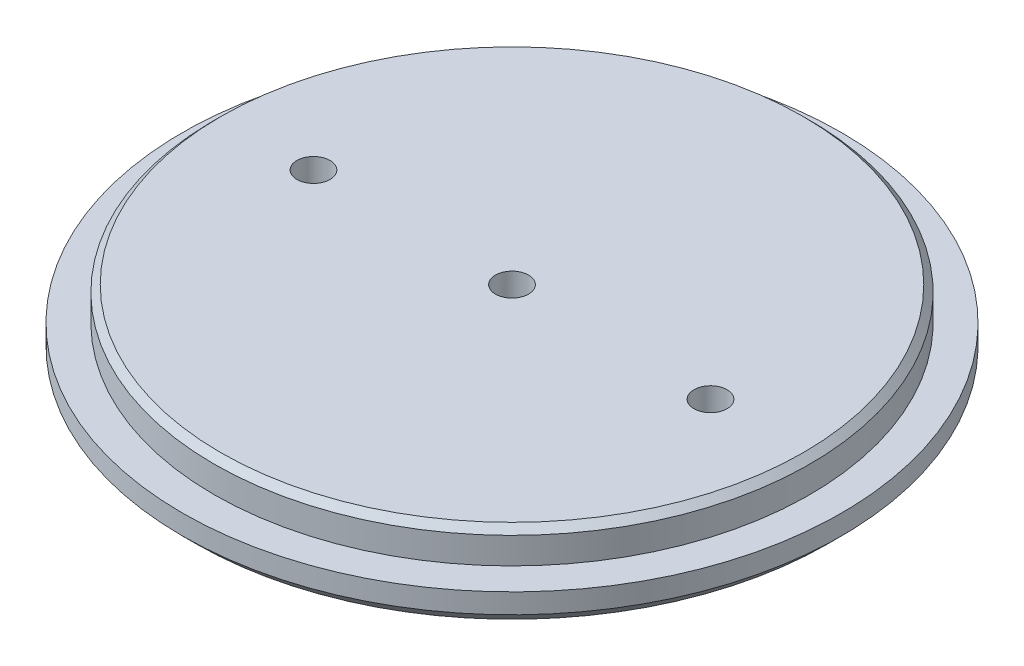
ISO-10303-21;
HEADER;
FILE_DESCRIPTION(('STEP AP214'),'2;1');
FILE_NAME('part.step','',(''),(''),'','','');
FILE_SCHEMA(('AUTOMOTIVE_DESIGN { 1 0 10303 214 1 1 1 1 }'));
ENDSEC;
DATA;
#1=APPLICATION_CONTEXT('core data for automotive mechanical design processes');
#2=APPLICATION_PROTOCOL_DEFINITION('international standard','automotive_design',2000,#1);
#3=PRODUCT_CONTEXT('',#1,'mechanical');
#4=PRODUCT('Part','Part','',(#3));
#5=PRODUCT_RELATED_PRODUCT_CATEGORY('part','',(#4));
#6=PRODUCT_DEFINITION_FORMATION('','',#4);
#7=PRODUCT_DEFINITION_CONTEXT('part definition',#1,'design');
#8=PRODUCT_DEFINITION('design','',#6,#7);
#9=PRODUCT_DEFINITION_SHAPE('','',#8);
#10=(LENGTH_UNIT() NAMED_UNIT(*) SI_UNIT(.MILLI.,.METRE.));
#11=(NAMED_UNIT(*) PLANE_ANGLE_UNIT() SI_UNIT($,.RADIAN.));
#12=(NAMED_UNIT(*) SI_UNIT($,.STERADIAN.) SOLID_ANGLE_UNIT());
#13=UNCERTAINTY_MEASURE_WITH_UNIT(LENGTH_MEASURE(1.E-05),#10,'distance_accuracy_value','');
#14=(GEOMETRIC_REPRESENTATION_CONTEXT(3) GLOBAL_UNCERTAINTY_ASSIGNED_CONTEXT((#13)) GLOBAL_UNIT_ASSIGNED_CONTEXT((#10,
#11,#12)) REPRESENTATION_CONTEXT('',''));
#15=CARTESIAN_POINT('',(0.,0.,0.));
#16=DIRECTION('',(0.,0.,1.));
#17=DIRECTION('',(1.,0.,0.));
#18=AXIS2_PLACEMENT_3D('',#15,#16,#17);
#19=CARTESIAN_POINT('',(0.,6.35,0.));
#20=DIRECTION('',(0.,-1.,0.));
#21=DIRECTION('',(0.,0.,-1.));
#22=AXIS2_PLACEMENT_3D('',#19,#20,#21);
#23=CYLINDRICAL_SURFACE('',#22,63.2460000000001);
#24=CARTESIAN_POINT('',(0.,2.54,0.));
#25=DIRECTION('',(0.,1.,0.));
#26=DIRECTION('',(0.,0.,1.));
#27=AXIS2_PLACEMENT_3D('',#24,#25,#26);
#28=CIRCLE('',#27,63.2460000000001);
#29=CARTESIAN_POINT('',(0.,2.54,63.2460000000001));
#30=VERTEX_POINT('',#29);
#31=EDGE_CURVE('E51',#30,#30,#28,.T.);
#32=ORIENTED_EDGE('',*,*,#31,.T.);
#33=EDGE_LOOP('',(#32));
#34=FACE_BOUND('',#33,.T.);
#35=CARTESIAN_POINT('',(0.,6.35,0.));
#36=DIRECTION('',(0.,1.,0.));
#37=DIRECTION('',(0.,0.,1.));
#38=AXIS2_PLACEMENT_3D('',#35,#36,#37);
#39=CIRCLE('',#38,63.2460000000001);
#40=CARTESIAN_POINT('',(0.,6.35,63.2460000000001));
#41=VERTEX_POINT('',#40);
#42=EDGE_CURVE('E68',#41,#41,#39,.T.);
#43=ORIENTED_EDGE('',*,*,#42,.F.);
#44=EDGE_LOOP('',(#43));
#45=FACE_BOUND('',#44,.T.);
#46=ADVANCED_FACE('F42',(#34,#45),#23,.T.);
#47=CARTESIAN_POINT('',(0.,6.35,0.));
#48=DIRECTION('',(0.,1.,0.));
#49=DIRECTION('',(0.,0.,1.));
#50=AXIS2_PLACEMENT_3D('',#47,#48,#49);
#51=PLANE('',#50);
#52=CARTESIAN_POINT('',(0.,6.35,0.));
#53=DIRECTION('',(0.,1.,0.));
#54=DIRECTION('',(0.,0.,1.));
#55=AXIS2_PLACEMENT_3D('',#52,#53,#54);
#56=CIRCLE('',#55,57.1500000000001);
#57=CARTESIAN_POINT('',(0.,6.35,57.1500000000001));
#58=VERTEX_POINT('',#57);
#59=EDGE_CURVE('E67',#58,#58,#56,.T.);
#60=ORIENTED_EDGE('',*,*,#59,.F.);
#61=EDGE_LOOP('',(#60));
#62=FACE_BOUND('',#61,.T.);
#63=ORIENTED_EDGE('',*,*,#42,.T.);
#64=EDGE_LOOP('',(#63));
#65=FACE_BOUND('',#64,.T.);
#66=ADVANCED_FACE('F114',(#62,#65),#51,.T.);
#67=CARTESIAN_POINT('',(0.,0.,0.));
#68=DIRECTION('',(0.,1.,0.));
#69=DIRECTION('',(0.,0.,1.));
#70=AXIS2_PLACEMENT_3D('',#67,#68,#69);
#71=PLANE('',#70);
#72=CARTESIAN_POINT('',(0.,0.,0.));
#73=DIRECTION('',(0.,1.,0.));
#74=DIRECTION('',(0.,0.,1.));
#75=AXIS2_PLACEMENT_3D('',#72,#73,#74);
#76=CIRCLE('',#75,60.7060000000001);
#77=CARTESIAN_POINT('',(0.,0.,60.7060000000001));
#78=VERTEX_POINT('',#77);
#79=EDGE_CURVE('E10',#78,#78,#76,.F.);
#80=ORIENTED_EDGE('',*,*,#79,.T.);
#81=EDGE_LOOP('',(#80));
#82=FACE_BOUND('',#81,.T.);
#83=CARTESIAN_POINT('',(-38.1,0.,0.));
#84=DIRECTION('',(0.,-1.,0.));
#85=DIRECTION('',(0.,0.,-1.));
#86=AXIS2_PLACEMENT_3D('',#83,#84,#85);
#87=CIRCLE('',#86,3.175);
#88=CARTESIAN_POINT('',(-38.1,0.,-3.175));
#89=VERTEX_POINT('',#88);
#90=EDGE_CURVE('E92',#89,#89,#87,.T.);
#91=ORIENTED_EDGE('',*,*,#90,.F.);
#92=EDGE_LOOP('',(#91));
#93=FACE_BOUND('',#92,.T.);
#94=CARTESIAN_POINT('',(0.,0.,0.));
#95=DIRECTION('',(0.,-1.,0.));
#96=DIRECTION('',(0.,0.,-1.));
#97=AXIS2_PLACEMENT_3D('',#94,#95,#96);
#98=CIRCLE('',#97,3.175);
#99=CARTESIAN_POINT('',(0.,0.,-3.175));
#100=VERTEX_POINT('',#99);
#101=EDGE_CURVE('E88',#100,#100,#98,.T.);
#102=ORIENTED_EDGE('',*,*,#101,.F.);
#103=EDGE_LOOP('',(#102));
#104=FACE_BOUND('',#103,.T.);
#105=CARTESIAN_POINT('',(38.1,0.,0.));
#106=DIRECTION('',(0.,-1.,0.));
#107=DIRECTION('',(0.,0.,-1.));
#108=AXIS2_PLACEMENT_3D('',#105,#106,#107);
#109=CIRCLE('',#108,3.175);
#110=CARTESIAN_POINT('',(38.1,0.,-3.17499999999998));
#111=VERTEX_POINT('',#110);
#112=EDGE_CURVE('E80',#111,#111,#109,.T.);
#113=ORIENTED_EDGE('',*,*,#112,.F.);
#114=EDGE_LOOP('',(#113));
#115=FACE_BOUND('',#114,.T.);
#116=ADVANCED_FACE('F110',(#82,#93,#104,#115),#71,.F.);
#117=CARTESIAN_POINT('',(0.,12.7,0.));
#118=DIRECTION('',(0.,-1.,0.));
#119=DIRECTION('',(0.,0.,-1.));
#120=AXIS2_PLACEMENT_3D('',#117,#118,#119);
#121=CYLINDRICAL_SURFACE('',#120,57.1500000000001);
#122=CARTESIAN_POINT('',(0.,11.43,0.));
#123=DIRECTION('',(0.,1.,0.));
#124=DIRECTION('',(0.,0.,1.));
#125=AXIS2_PLACEMENT_3D('',#122,#123,#124);
#126=CIRCLE('',#125,57.1500000000001);
#127=CARTESIAN_POINT('',(0.,11.43,57.1500000000001));
#128=VERTEX_POINT('',#127);
#129=EDGE_CURVE('E56',#128,#128,#126,.F.);
#130=ORIENTED_EDGE('',*,*,#129,.T.);
#131=EDGE_LOOP('',(#130));
#132=FACE_BOUND('',#131,.T.);
#133=ORIENTED_EDGE('',*,*,#59,.T.);
#134=EDGE_LOOP('',(#133));
#135=FACE_BOUND('',#134,.T.);
#136=ADVANCED_FACE('F113',(#132,#135),#121,.T.);
#137=CARTESIAN_POINT('',(0.,12.7,0.));
#138=DIRECTION('',(0.,1.,0.));
#139=DIRECTION('',(0.,0.,1.));
#140=AXIS2_PLACEMENT_3D('',#137,#138,#139);
#141=PLANE('',#140);
#142=CARTESIAN_POINT('',(-38.1,12.7,0.));
#143=DIRECTION('',(0.,-1.,0.));
#144=DIRECTION('',(0.,0.,-1.));
#145=AXIS2_PLACEMENT_3D('',#142,#143,#144);
#146=CIRCLE('',#145,3.175);
#147=CARTESIAN_POINT('',(-38.1,12.7,-3.175));
#148=VERTEX_POINT('',#147);
#149=EDGE_CURVE('E72',#148,#148,#146,.T.);
#150=ORIENTED_EDGE('',*,*,#149,.T.);
#151=EDGE_LOOP('',(#150));
#152=FACE_BOUND('',#151,.T.);
#153=CARTESIAN_POINT('',(0.,12.7,0.));
#154=DIRECTION('',(0.,-1.,0.));
#155=DIRECTION('',(0.,0.,-1.));
#156=AXIS2_PLACEMENT_3D('',#153,#154,#155);
#157=CIRCLE('',#156,3.175);
#158=CARTESIAN_POINT('',(0.,12.7,-3.175));
#159=VERTEX_POINT('',#158);
#160=EDGE_CURVE('E84',#159,#159,#157,.T.);
#161=ORIENTED_EDGE('',*,*,#160,.T.);
#162=EDGE_LOOP('',(#161));
#163=FACE_BOUND('',#162,.T.);
#164=CARTESIAN_POINT('',(38.1,12.7,0.));
#165=DIRECTION('',(0.,-1.,0.));
#166=DIRECTION('',(0.,0.,-1.));
#167=AXIS2_PLACEMENT_3D('',#164,#165,#166);
#168=CIRCLE('',#167,3.175);
#169=CARTESIAN_POINT('',(38.1,12.7,-3.17499999999998));
#170=VERTEX_POINT('',#169);
#171=EDGE_CURVE('E76',#170,#170,#168,.T.);
#172=ORIENTED_EDGE('',*,*,#171,.T.);
#173=EDGE_LOOP('',(#172));
#174=FACE_BOUND('',#173,.T.);
#175=CARTESIAN_POINT('',(0.,12.7,0.));
#176=DIRECTION('',(0.,1.,0.));
#177=DIRECTION('',(0.,0.,1.));
#178=AXIS2_PLACEMENT_3D('',#175,#176,#177);
#179=CIRCLE('',#178,55.8800000000001);
#180=CARTESIAN_POINT('',(0.,12.7,55.8800000000001));
#181=VERTEX_POINT('',#180);
#182=EDGE_CURVE('E61',#181,#181,#179,.T.);
#183=ORIENTED_EDGE('',*,*,#182,.T.);
#184=EDGE_LOOP('',(#183));
#185=FACE_BOUND('',#184,.T.);
#186=ADVANCED_FACE('F100',(#152,#163,#174,#185),#141,.T.);
#187=CARTESIAN_POINT('',(0.,12.7,0.));
#188=DIRECTION('',(0.,-1.,0.));
#189=DIRECTION('',(0.,0.,-1.));
#190=AXIS2_PLACEMENT_3D('',#187,#188,#189);
#191=CONICAL_SURFACE('',#190,55.8800000000001,0.785398163397443);
#192=ORIENTED_EDGE('',*,*,#129,.F.);
#193=EDGE_LOOP('',(#192));
#194=FACE_BOUND('',#193,.T.);
#195=ORIENTED_EDGE('',*,*,#182,.F.);
#196=EDGE_LOOP('',(#195));
#197=FACE_BOUND('',#196,.T.);
#198=ADVANCED_FACE('F122',(#194,#197),#191,.T.);
#199=CARTESIAN_POINT('',(38.1,12.7,0.));
#200=DIRECTION('',(0.,-1.,0.));
#201=DIRECTION('',(0.,0.,-1.));
#202=AXIS2_PLACEMENT_3D('',#199,#200,#201);
#203=CYLINDRICAL_SURFACE('',#202,3.175);
#204=ORIENTED_EDGE('',*,*,#171,.F.);
#205=EDGE_LOOP('',(#204));
#206=FACE_BOUND('',#205,.T.);
#207=ORIENTED_EDGE('',*,*,#112,.T.);
#208=EDGE_LOOP('',(#207));
#209=FACE_BOUND('',#208,.T.);
#210=ADVANCED_FACE('F120',(#206,#209),#203,.F.);
#211=CARTESIAN_POINT('',(0.,12.7,0.));
#212=DIRECTION('',(0.,-1.,0.));
#213=DIRECTION('',(0.,0.,-1.));
#214=AXIS2_PLACEMENT_3D('',#211,#212,#213);
#215=CYLINDRICAL_SURFACE('',#214,3.175);
#216=ORIENTED_EDGE('',*,*,#160,.F.);
#217=EDGE_LOOP('',(#216));
#218=FACE_BOUND('',#217,.T.);
#219=ORIENTED_EDGE('',*,*,#101,.T.);
#220=EDGE_LOOP('',(#219));
#221=FACE_BOUND('',#220,.T.);
#222=ADVANCED_FACE('F106',(#218,#221),#215,.F.);
#223=CARTESIAN_POINT('',(-38.1,12.7,0.));
#224=DIRECTION('',(0.,-1.,0.));
#225=DIRECTION('',(0.,0.,-1.));
#226=AXIS2_PLACEMENT_3D('',#223,#224,#225);
#227=CYLINDRICAL_SURFACE('',#226,3.175);
#228=ORIENTED_EDGE('',*,*,#149,.F.);
#229=EDGE_LOOP('',(#228));
#230=FACE_BOUND('',#229,.T.);
#231=ORIENTED_EDGE('',*,*,#90,.T.);
#232=EDGE_LOOP('',(#231));
#233=FACE_BOUND('',#232,.T.);
#234=ADVANCED_FACE('F103',(#230,#233),#227,.F.);
#235=CARTESIAN_POINT('',(0.,2.54,0.));
#236=DIRECTION('',(0.,1.,0.));
#237=DIRECTION('',(0.,0.,1.));
#238=AXIS2_PLACEMENT_3D('',#235,#236,#237);
#239=CONICAL_SURFACE('',#238,63.2460000000001,0.785398163397448);
#240=ORIENTED_EDGE('',*,*,#79,.F.);
#241=EDGE_LOOP('',(#240));
#242=FACE_BOUND('',#241,.T.);
#243=ORIENTED_EDGE('',*,*,#31,.F.);
#244=EDGE_LOOP('',(#243));
#245=FACE_BOUND('',#244,.T.);
#246=ADVANCED_FACE('F45',(#242,#245),#239,.T.);
#247=CLOSED_SHELL('',(#46,#66,#116,#136,#186,#198,#210,#222,#234,#246));
#248=MANIFOLD_SOLID_BREP('B2',#247);
#249=ADVANCED_BREP_SHAPE_REPRESENTATION('',(#18,#248),#14);
#250=SHAPE_DEFINITION_REPRESENTATION(#9,#249);
ENDSEC;
END-ISO-10303-21;
